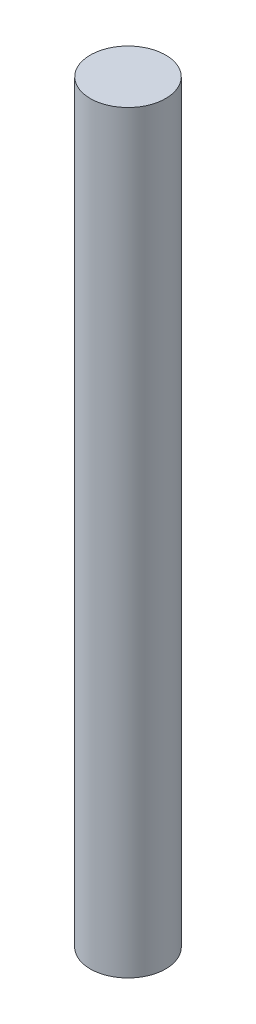
ISO-10303-21;
HEADER;
FILE_DESCRIPTION(('STEP AP214'),'2;1');
FILE_NAME('part.step','',(''),(''),'','','');
FILE_SCHEMA(('AUTOMOTIVE_DESIGN { 1 0 10303 214 1 1 1 1 }'));
ENDSEC;
DATA;
#1=APPLICATION_CONTEXT('core data for automotive mechanical design processes');
#2=APPLICATION_PROTOCOL_DEFINITION('international standard','automotive_design',2000,#1);
#3=PRODUCT_CONTEXT('',#1,'mechanical');
#4=PRODUCT('Part','Part','',(#3));
#5=PRODUCT_RELATED_PRODUCT_CATEGORY('part','',(#4));
#6=PRODUCT_DEFINITION_FORMATION('','',#4);
#7=PRODUCT_DEFINITION_CONTEXT('part definition',#1,'design');
#8=PRODUCT_DEFINITION('design','',#6,#7);
#9=PRODUCT_DEFINITION_SHAPE('','',#8);
#10=(LENGTH_UNIT() NAMED_UNIT(*) SI_UNIT(.MILLI.,.METRE.));
#11=(NAMED_UNIT(*) PLANE_ANGLE_UNIT() SI_UNIT($,.RADIAN.));
#12=(NAMED_UNIT(*) SI_UNIT($,.STERADIAN.) SOLID_ANGLE_UNIT());
#13=UNCERTAINTY_MEASURE_WITH_UNIT(LENGTH_MEASURE(1.E-05),#10,'distance_accuracy_value','');
#14=(GEOMETRIC_REPRESENTATION_CONTEXT(3) GLOBAL_UNCERTAINTY_ASSIGNED_CONTEXT((#13)) GLOBAL_UNIT_ASSIGNED_CONTEXT((#10,
#11,#12)) REPRESENTATION_CONTEXT('',''));
#15=CARTESIAN_POINT('',(0.,0.,0.));
#16=DIRECTION('',(0.,0.,1.));
#17=DIRECTION('',(1.,0.,0.));
#18=AXIS2_PLACEMENT_3D('',#15,#16,#17);
#19=CARTESIAN_POINT('',(0.,30.,0.));
#20=DIRECTION('',(0.,-1.,0.));
#21=DIRECTION('',(0.,0.,-1.));
#22=AXIS2_PLACEMENT_3D('',#19,#20,#21);
#23=CYLINDRICAL_SURFACE('',#22,1.5);
#24=CARTESIAN_POINT('',(0.,30.,0.));
#25=DIRECTION('',(0.,1.,0.));
#26=DIRECTION('',(0.,0.,1.));
#27=AXIS2_PLACEMENT_3D('',#24,#25,#26);
#28=CIRCLE('',#27,1.5);
#29=CARTESIAN_POINT('',(0.,30.,1.5));
#30=VERTEX_POINT('',#29);
#31=EDGE_CURVE('E10',#30,#30,#28,.T.);
#32=ORIENTED_EDGE('',*,*,#31,.F.);
#33=EDGE_LOOP('',(#32));
#34=FACE_BOUND('',#33,.T.);
#35=CARTESIAN_POINT('',(0.,0.,0.));
#36=DIRECTION('',(0.,1.,0.));
#37=DIRECTION('',(0.,0.,1.));
#38=AXIS2_PLACEMENT_3D('',#35,#36,#37);
#39=CIRCLE('',#38,1.5);
#40=CARTESIAN_POINT('',(0.,0.,1.5));
#41=VERTEX_POINT('',#40);
#42=EDGE_CURVE('E35',#41,#41,#39,.T.);
#43=ORIENTED_EDGE('',*,*,#42,.T.);
#44=EDGE_LOOP('',(#43));
#45=FACE_BOUND('',#44,.T.);
#46=ADVANCED_FACE('F32',(#34,#45),#23,.T.);
#47=CARTESIAN_POINT('',(0.,30.,0.));
#48=DIRECTION('',(0.,1.,0.));
#49=DIRECTION('',(0.,0.,1.));
#50=AXIS2_PLACEMENT_3D('',#47,#48,#49);
#51=PLANE('',#50);
#52=ORIENTED_EDGE('',*,*,#31,.T.);
#53=EDGE_LOOP('',(#52));
#54=FACE_BOUND('',#53,.T.);
#55=ADVANCED_FACE('F47',(#54),#51,.T.);
#56=CARTESIAN_POINT('',(0.,0.,0.));
#57=DIRECTION('',(0.,1.,0.));
#58=DIRECTION('',(0.,0.,1.));
#59=AXIS2_PLACEMENT_3D('',#56,#57,#58);
#60=PLANE('',#59);
#61=ORIENTED_EDGE('',*,*,#42,.F.);
#62=EDGE_LOOP('',(#61));
#63=FACE_BOUND('',#62,.T.);
#64=ADVANCED_FACE('F45',(#63),#60,.F.);
#65=CLOSED_SHELL('',(#46,#55,#64));
#66=MANIFOLD_SOLID_BREP('B2',#65);
#67=ADVANCED_BREP_SHAPE_REPRESENTATION('',(#18,#66),#14);
#68=SHAPE_DEFINITION_REPRESENTATION(#9,#67);
ENDSEC;
END-ISO-10303-21;
